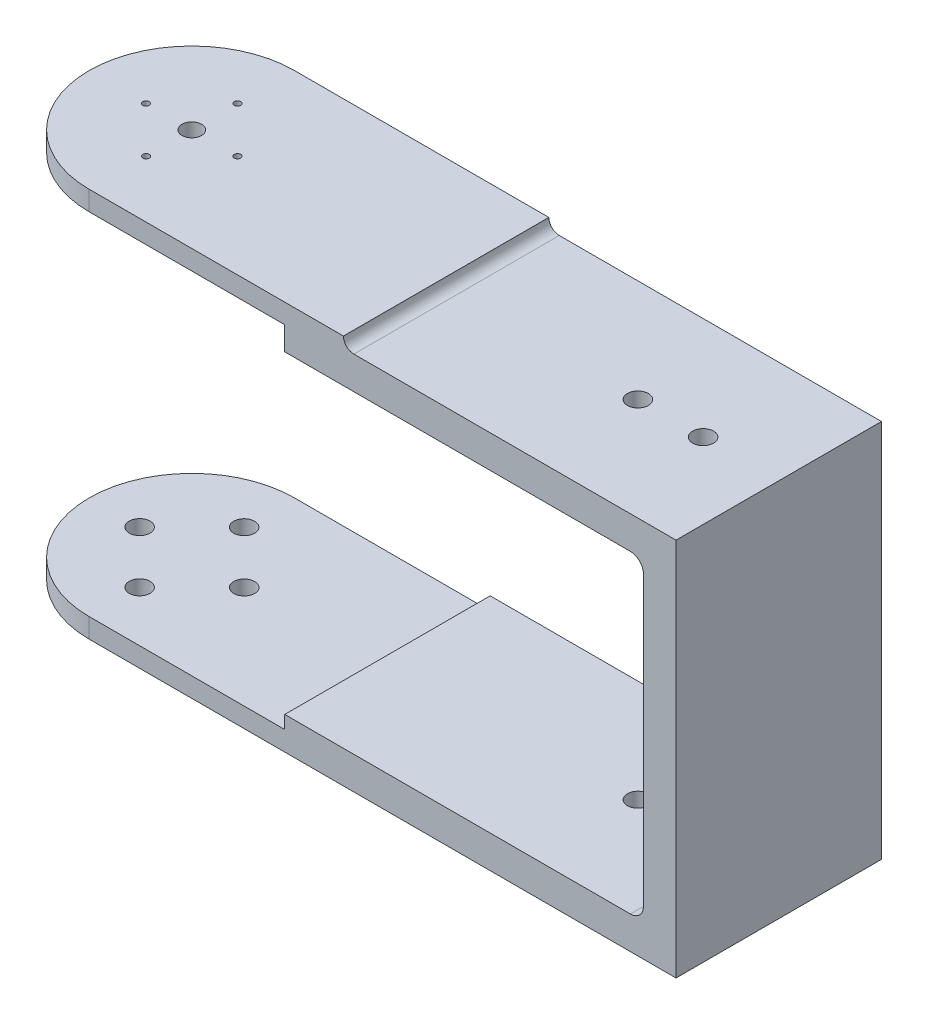
ISO-10303-21;
HEADER;
FILE_DESCRIPTION(('STEP AP214'),'2;1');
FILE_NAME('part.step','',(''),(''),'','','');
FILE_SCHEMA(('AUTOMOTIVE_DESIGN { 1 0 10303 214 1 1 1 1 }'));
ENDSEC;
DATA;
#1=APPLICATION_CONTEXT('core data for automotive mechanical design processes');
#2=APPLICATION_PROTOCOL_DEFINITION('international standard','automotive_design',2000,#1);
#3=PRODUCT_CONTEXT('',#1,'mechanical');
#4=PRODUCT('Part','Part','',(#3));
#5=PRODUCT_RELATED_PRODUCT_CATEGORY('part','',(#4));
#6=PRODUCT_DEFINITION_FORMATION('','',#4);
#7=PRODUCT_DEFINITION_CONTEXT('part definition',#1,'design');
#8=PRODUCT_DEFINITION('design','',#6,#7);
#9=PRODUCT_DEFINITION_SHAPE('','',#8);
#10=(LENGTH_UNIT() NAMED_UNIT(*) SI_UNIT(.MILLI.,.METRE.));
#11=(NAMED_UNIT(*) PLANE_ANGLE_UNIT() SI_UNIT($,.RADIAN.));
#12=(NAMED_UNIT(*) SI_UNIT($,.STERADIAN.) SOLID_ANGLE_UNIT());
#13=UNCERTAINTY_MEASURE_WITH_UNIT(LENGTH_MEASURE(1.E-05),#10,'distance_accuracy_value','');
#14=(GEOMETRIC_REPRESENTATION_CONTEXT(3) GLOBAL_UNCERTAINTY_ASSIGNED_CONTEXT((#13)) GLOBAL_UNIT_ASSIGNED_CONTEXT((#10,
#11,#12)) REPRESENTATION_CONTEXT('',''));
#15=CARTESIAN_POINT('',(0.,0.,0.));
#16=DIRECTION('',(0.,0.,1.));
#17=DIRECTION('',(1.,0.,0.));
#18=AXIS2_PLACEMENT_3D('',#15,#16,#17);
#19=CARTESIAN_POINT('',(0.,1.6,0.));
#20=DIRECTION('',(0.,-1.,0.));
#21=DIRECTION('',(0.,0.,-1.));
#22=AXIS2_PLACEMENT_3D('',#19,#20,#21);
#23=PLANE('',#22);
#24=DIRECTION('',(1.,0.,0.));
#25=VECTOR('',#24,1.);
#26=CARTESIAN_POINT('',(0.,1.6,-15.75));
#27=LINE('',#26,#25);
#28=CARTESIAN_POINT('',(0.,1.6,-15.75));
#29=VERTEX_POINT('',#28);
#30=CARTESIAN_POINT('',(30.,1.6,-15.75));
#31=VERTEX_POINT('',#30);
#32=EDGE_CURVE('E193',#29,#31,#27,.T.);
#33=ORIENTED_EDGE('',*,*,#32,.T.);
#34=DIRECTION('',(0.,0.,1.));
#35=VECTOR('',#34,1.);
#36=CARTESIAN_POINT('',(30.,1.6,-15.75));
#37=LINE('',#36,#35);
#38=CARTESIAN_POINT('',(30.,1.6,15.75));
#39=VERTEX_POINT('',#38);
#40=EDGE_CURVE('E196',#31,#39,#37,.T.);
#41=ORIENTED_EDGE('',*,*,#40,.T.);
#42=DIRECTION('',(-1.,0.,0.));
#43=VECTOR('',#42,1.);
#44=CARTESIAN_POINT('',(30.,1.6,15.75));
#45=LINE('',#44,#43);
#46=CARTESIAN_POINT('',(0.,1.6,15.75));
#47=VERTEX_POINT('',#46);
#48=EDGE_CURVE('E199',#39,#47,#45,.T.);
#49=ORIENTED_EDGE('',*,*,#48,.T.);
#50=CARTESIAN_POINT('',(0.,1.6,0.));
#51=DIRECTION('',(0.,-1.,0.));
#52=DIRECTION('',(0.,0.,-1.));
#53=AXIS2_PLACEMENT_3D('',#50,#51,#52);
#54=CIRCLE('',#53,15.75);
#55=EDGE_CURVE('E201',#47,#29,#54,.T.);
#56=ORIENTED_EDGE('',*,*,#55,.T.);
#57=EDGE_LOOP('',(#33,#41,#49,#56));
#58=FACE_BOUND('',#57,.T.);
#59=CARTESIAN_POINT('',(0.,1.6,0.));
#60=DIRECTION('',(0.,-1.,0.));
#61=DIRECTION('',(0.,0.,-1.));
#62=AXIS2_PLACEMENT_3D('',#59,#60,#61);
#63=CIRCLE('',#62,10.);
#64=CARTESIAN_POINT('',(0.,1.6,-10.));
#65=VERTEX_POINT('',#64);
#66=EDGE_CURVE('E176',#65,#65,#63,.T.);
#67=ORIENTED_EDGE('',*,*,#66,.F.);
#68=EDGE_LOOP('',(#67));
#69=FACE_BOUND('',#68,.T.);
#70=ADVANCED_FACE('F40',(#58,#69),#23,.T.);
#71=CARTESIAN_POINT('',(40.6,4.6,0.));
#72=DIRECTION('',(0.,0.,1.));
#73=DIRECTION('',(1.,0.,0.));
#74=AXIS2_PLACEMENT_3D('',#71,#72,#73);
#75=CYLINDRICAL_SURFACE('',#74,1.6);
#76=DIRECTION('',(0.,0.,1.));
#77=VECTOR('',#76,1.);
#78=CARTESIAN_POINT('',(39.,4.6,15.75));
#79=LINE('',#78,#77);
#80=CARTESIAN_POINT('',(39.,4.6,-15.75));
#81=VERTEX_POINT('',#80);
#82=CARTESIAN_POINT('',(39.,4.6,15.75));
#83=VERTEX_POINT('',#82);
#84=EDGE_CURVE('E151',#81,#83,#79,.T.);
#85=ORIENTED_EDGE('',*,*,#84,.T.);
#86=CARTESIAN_POINT('',(40.6,4.6,15.75));
#87=DIRECTION('',(0.,0.,-1.));
#88=DIRECTION('',(-1.,0.,0.));
#89=AXIS2_PLACEMENT_3D('',#86,#87,#88);
#90=CIRCLE('',#89,1.6);
#91=CARTESIAN_POINT('',(40.6,3.,15.75));
#92=VERTEX_POINT('',#91);
#93=EDGE_CURVE('E61',#83,#92,#90,.F.);
#94=ORIENTED_EDGE('',*,*,#93,.T.);
#95=DIRECTION('',(0.,0.,-1.));
#96=VECTOR('',#95,1.);
#97=CARTESIAN_POINT('',(40.6,3.,0.));
#98=LINE('',#97,#96);
#99=CARTESIAN_POINT('',(40.6,3.,-15.75));
#100=VERTEX_POINT('',#99);
#101=EDGE_CURVE('E152',#100,#92,#98,.F.);
#102=ORIENTED_EDGE('',*,*,#101,.F.);
#103=CARTESIAN_POINT('',(40.6,4.6,-15.75));
#104=DIRECTION('',(0.,0.,1.));
#105=DIRECTION('',(1.,0.,0.));
#106=AXIS2_PLACEMENT_3D('',#103,#104,#105);
#107=CIRCLE('',#106,1.6);
#108=EDGE_CURVE('E48',#100,#81,#107,.F.);
#109=ORIENTED_EDGE('',*,*,#108,.T.);
#110=EDGE_LOOP('',(#85,#94,#102,#109));
#111=FACE_BOUND('',#110,.T.);
#112=ADVANCED_FACE('F42',(#111),#75,.F.);
#113=CARTESIAN_POINT('',(0.,3.,0.));
#114=DIRECTION('',(0.,-1.,0.));
#115=DIRECTION('',(0.,0.,-1.));
#116=AXIS2_PLACEMENT_3D('',#113,#114,#115);
#117=CYLINDRICAL_SURFACE('',#116,15.75);
#118=ORIENTED_EDGE('',*,*,#55,.F.);
#119=DIRECTION('',(0.,-1.,0.));
#120=VECTOR('',#119,1.);
#121=CARTESIAN_POINT('',(0.,3.,15.75));
#122=LINE('',#121,#120);
#123=CARTESIAN_POINT('',(0.,4.6,15.75));
#124=VERTEX_POINT('',#123);
#125=EDGE_CURVE('E291',#124,#47,#122,.T.);
#126=ORIENTED_EDGE('',*,*,#125,.F.);
#127=CARTESIAN_POINT('',(0.,4.6,0.));
#128=DIRECTION('',(0.,-1.,0.));
#129=DIRECTION('',(0.,0.,-1.));
#130=AXIS2_PLACEMENT_3D('',#127,#128,#129);
#131=CIRCLE('',#130,15.75);
#132=CARTESIAN_POINT('',(0.,4.6,-15.75));
#133=VERTEX_POINT('',#132);
#134=EDGE_CURVE('E164',#124,#133,#131,.T.);
#135=ORIENTED_EDGE('',*,*,#134,.T.);
#136=DIRECTION('',(0.,-1.,0.));
#137=VECTOR('',#136,1.);
#138=CARTESIAN_POINT('',(0.,3.,-15.75));
#139=LINE('',#138,#137);
#140=EDGE_CURVE('E159',#133,#29,#139,.T.);
#141=ORIENTED_EDGE('',*,*,#140,.T.);
#142=EDGE_LOOP('',(#118,#126,#135,#141));
#143=FACE_BOUND('',#142,.T.);
#144=ADVANCED_FACE('F382',(#143),#117,.T.);
#145=CARTESIAN_POINT('',(-7.,10.,0.));
#146=DIRECTION('',(0.,-1.,0.));
#147=DIRECTION('',(0.,0.,-1.));
#148=AXIS2_PLACEMENT_3D('',#145,#146,#147);
#149=CYLINDRICAL_SURFACE('',#148,0.5);
#150=CARTESIAN_POINT('',(-7.,4.6,0.));
#151=DIRECTION('',(0.,-1.,0.));
#152=DIRECTION('',(0.,0.,-1.));
#153=AXIS2_PLACEMENT_3D('',#150,#151,#152);
#154=CIRCLE('',#153,0.5);
#155=CARTESIAN_POINT('',(-7.,4.6,-0.5));
#156=VERTEX_POINT('',#155);
#157=EDGE_CURVE('E185',#156,#156,#154,.T.);
#158=ORIENTED_EDGE('',*,*,#157,.F.);
#159=EDGE_LOOP('',(#158));
#160=FACE_BOUND('',#159,.T.);
#161=CARTESIAN_POINT('',(-7.,0.,0.));
#162=DIRECTION('',(0.,-1.,0.));
#163=DIRECTION('',(0.,0.,-1.));
#164=AXIS2_PLACEMENT_3D('',#161,#162,#163);
#165=CIRCLE('',#164,0.5);
#166=CARTESIAN_POINT('',(-7.,0.,-0.5));
#167=VERTEX_POINT('',#166);
#168=EDGE_CURVE('E440',#167,#167,#165,.T.);
#169=ORIENTED_EDGE('',*,*,#168,.T.);
#170=EDGE_LOOP('',(#169));
#171=FACE_BOUND('',#170,.T.);
#172=ADVANCED_FACE('F384',(#160,#171),#149,.F.);
#173=CARTESIAN_POINT('',(0.,10.,-7.));
#174=DIRECTION('',(0.,-1.,0.));
#175=DIRECTION('',(0.,0.,-1.));
#176=AXIS2_PLACEMENT_3D('',#173,#174,#175);
#177=CYLINDRICAL_SURFACE('',#176,0.5);
#178=CARTESIAN_POINT('',(0.,4.6,-7.));
#179=DIRECTION('',(0.,-1.,0.));
#180=DIRECTION('',(0.,0.,-1.));
#181=AXIS2_PLACEMENT_3D('',#178,#179,#180);
#182=CIRCLE('',#181,0.500000000000001);
#183=CARTESIAN_POINT('',(0.,4.6,-7.5));
#184=VERTEX_POINT('',#183);
#185=EDGE_CURVE('E188',#184,#184,#182,.T.);
#186=ORIENTED_EDGE('',*,*,#185,.F.);
#187=EDGE_LOOP('',(#186));
#188=FACE_BOUND('',#187,.T.);
#189=CARTESIAN_POINT('',(0.,0.,-7.));
#190=DIRECTION('',(0.,-1.,0.));
#191=DIRECTION('',(0.,0.,-1.));
#192=AXIS2_PLACEMENT_3D('',#189,#190,#191);
#193=CIRCLE('',#192,0.500000000000001);
#194=CARTESIAN_POINT('',(0.,0.,-7.5));
#195=VERTEX_POINT('',#194);
#196=EDGE_CURVE('E437',#195,#195,#193,.T.);
#197=ORIENTED_EDGE('',*,*,#196,.T.);
#198=EDGE_LOOP('',(#197));
#199=FACE_BOUND('',#198,.T.);
#200=ADVANCED_FACE('F391',(#188,#199),#177,.F.);
#201=CARTESIAN_POINT('',(7.,10.,0.));
#202=DIRECTION('',(0.,-1.,0.));
#203=DIRECTION('',(0.,0.,-1.));
#204=AXIS2_PLACEMENT_3D('',#201,#202,#203);
#205=CYLINDRICAL_SURFACE('',#204,0.5);
#206=CARTESIAN_POINT('',(7.,4.6,0.));
#207=DIRECTION('',(0.,-1.,0.));
#208=DIRECTION('',(0.,0.,-1.));
#209=AXIS2_PLACEMENT_3D('',#206,#207,#208);
#210=CIRCLE('',#209,0.5);
#211=CARTESIAN_POINT('',(7.,4.6,-0.5));
#212=VERTEX_POINT('',#211);
#213=EDGE_CURVE('E169',#212,#212,#210,.T.);
#214=ORIENTED_EDGE('',*,*,#213,.F.);
#215=EDGE_LOOP('',(#214));
#216=FACE_BOUND('',#215,.T.);
#217=CARTESIAN_POINT('',(7.,0.,0.));
#218=DIRECTION('',(0.,-1.,0.));
#219=DIRECTION('',(0.,0.,-1.));
#220=AXIS2_PLACEMENT_3D('',#217,#218,#219);
#221=CIRCLE('',#220,0.5);
#222=CARTESIAN_POINT('',(7.,0.,-0.5));
#223=VERTEX_POINT('',#222);
#224=EDGE_CURVE('E439',#223,#223,#221,.T.);
#225=ORIENTED_EDGE('',*,*,#224,.T.);
#226=EDGE_LOOP('',(#225));
#227=FACE_BOUND('',#226,.T.);
#228=ADVANCED_FACE('F433',(#216,#227),#205,.F.);
#229=CARTESIAN_POINT('',(0.,10.,7.));
#230=DIRECTION('',(0.,-1.,0.));
#231=DIRECTION('',(0.,0.,-1.));
#232=AXIS2_PLACEMENT_3D('',#229,#230,#231);
#233=CYLINDRICAL_SURFACE('',#232,0.5);
#234=CARTESIAN_POINT('',(0.,4.6,7.));
#235=DIRECTION('',(0.,-1.,0.));
#236=DIRECTION('',(0.,0.,-1.));
#237=AXIS2_PLACEMENT_3D('',#234,#235,#236);
#238=CIRCLE('',#237,0.500000000000001);
#239=CARTESIAN_POINT('',(0.,4.6,6.5));
#240=VERTEX_POINT('',#239);
#241=EDGE_CURVE('E173',#240,#240,#238,.T.);
#242=ORIENTED_EDGE('',*,*,#241,.F.);
#243=EDGE_LOOP('',(#242));
#244=FACE_BOUND('',#243,.T.);
#245=CARTESIAN_POINT('',(0.,0.,7.));
#246=DIRECTION('',(0.,-1.,0.));
#247=DIRECTION('',(0.,0.,-1.));
#248=AXIS2_PLACEMENT_3D('',#245,#246,#247);
#249=CIRCLE('',#248,0.5);
#250=CARTESIAN_POINT('',(0.,0.,6.5));
#251=VERTEX_POINT('',#250);
#252=EDGE_CURVE('E446',#251,#251,#249,.T.);
#253=ORIENTED_EDGE('',*,*,#252,.T.);
#254=EDGE_LOOP('',(#253));
#255=FACE_BOUND('',#254,.T.);
#256=ADVANCED_FACE('F422',(#244,#255),#233,.F.);
#257=CARTESIAN_POINT('',(0.,-7.,0.));
#258=DIRECTION('',(0.,1.,0.));
#259=DIRECTION('',(0.,0.,1.));
#260=AXIS2_PLACEMENT_3D('',#257,#258,#259);
#261=CYLINDRICAL_SURFACE('',#260,1.5);
#262=CARTESIAN_POINT('',(0.,1.6,0.));
#263=DIRECTION('',(0.,-1.,0.));
#264=DIRECTION('',(0.,0.,-1.));
#265=AXIS2_PLACEMENT_3D('',#262,#263,#264);
#266=CIRCLE('',#265,1.5);
#267=CARTESIAN_POINT('',(0.,1.6,-1.5));
#268=VERTEX_POINT('',#267);
#269=EDGE_CURVE('E203',#268,#268,#266,.F.);
#270=ORIENTED_EDGE('',*,*,#269,.F.);
#271=EDGE_LOOP('',(#270));
#272=FACE_BOUND('',#271,.T.);
#273=CARTESIAN_POINT('',(0.,4.6,0.));
#274=DIRECTION('',(0.,-1.,0.));
#275=DIRECTION('',(0.,0.,-1.));
#276=AXIS2_PLACEMENT_3D('',#273,#274,#275);
#277=CIRCLE('',#276,1.5);
#278=CARTESIAN_POINT('',(0.,4.6,-1.5));
#279=VERTEX_POINT('',#278);
#280=EDGE_CURVE('E182',#279,#279,#277,.T.);
#281=ORIENTED_EDGE('',*,*,#280,.F.);
#282=EDGE_LOOP('',(#281));
#283=FACE_BOUND('',#282,.T.);
#284=ADVANCED_FACE('F420',(#272,#283),#261,.F.);
#285=CARTESIAN_POINT('',(83.,-48.15,15.75));
#286=DIRECTION('',(0.,0.,-1.));
#287=DIRECTION('',(-1.,0.,0.));
#288=AXIS2_PLACEMENT_3D('',#285,#286,#287);
#289=CYLINDRICAL_SURFACE('',#288,2.);
#290=DIRECTION('',(0.,0.,1.));
#291=VECTOR('',#290,1.);
#292=CARTESIAN_POINT('',(85.,-48.15,15.75));
#293=LINE('',#292,#291);
#294=CARTESIAN_POINT('',(85.,-48.15,-15.75));
#295=VERTEX_POINT('',#294);
#296=CARTESIAN_POINT('',(85.,-48.15,15.75));
#297=VERTEX_POINT('',#296);
#298=EDGE_CURVE('E307',#295,#297,#293,.T.);
#299=ORIENTED_EDGE('',*,*,#298,.F.);
#300=CARTESIAN_POINT('',(83.,-48.15,-15.75));
#301=DIRECTION('',(0.,0.,1.));
#302=DIRECTION('',(1.,0.,0.));
#303=AXIS2_PLACEMENT_3D('',#300,#301,#302);
#304=CIRCLE('',#303,2.);
#305=CARTESIAN_POINT('',(83.,-50.15,-15.75));
#306=VERTEX_POINT('',#305);
#307=EDGE_CURVE('E313',#295,#306,#304,.F.);
#308=ORIENTED_EDGE('',*,*,#307,.T.);
#309=DIRECTION('',(0.,0.,1.));
#310=VECTOR('',#309,1.);
#311=CARTESIAN_POINT('',(83.,-50.15,15.75));
#312=LINE('',#311,#310);
#313=CARTESIAN_POINT('',(83.,-50.15,15.75));
#314=VERTEX_POINT('',#313);
#315=EDGE_CURVE('E310',#314,#306,#312,.F.);
#316=ORIENTED_EDGE('',*,*,#315,.F.);
#317=CARTESIAN_POINT('',(83.,-48.15,15.75));
#318=DIRECTION('',(0.,0.,-1.));
#319=DIRECTION('',(-1.,0.,0.));
#320=AXIS2_PLACEMENT_3D('',#317,#318,#319);
#321=CIRCLE('',#320,2.);
#322=EDGE_CURVE('E315',#314,#297,#321,.F.);
#323=ORIENTED_EDGE('',*,*,#322,.T.);
#324=EDGE_LOOP('',(#299,#308,#316,#323));
#325=FACE_BOUND('',#324,.T.);
#326=ADVANCED_FACE('F360',(#325),#289,.F.);
#327=CARTESIAN_POINT('',(83.,-4.,15.75));
#328=DIRECTION('',(0.,0.,-1.));
#329=DIRECTION('',(-1.,0.,0.));
#330=AXIS2_PLACEMENT_3D('',#327,#328,#329);
#331=CYLINDRICAL_SURFACE('',#330,2.);
#332=DIRECTION('',(0.,0.,-1.));
#333=VECTOR('',#332,1.);
#334=CARTESIAN_POINT('',(85.,-4.,15.75));
#335=LINE('',#334,#333);
#336=CARTESIAN_POINT('',(85.,-4.,15.75));
#337=VERTEX_POINT('',#336);
#338=CARTESIAN_POINT('',(85.,-4.,-15.75));
#339=VERTEX_POINT('',#338);
#340=EDGE_CURVE('E294',#337,#339,#335,.T.);
#341=ORIENTED_EDGE('',*,*,#340,.F.);
#342=CARTESIAN_POINT('',(83.,-4.,15.75));
#343=DIRECTION('',(0.,0.,-1.));
#344=DIRECTION('',(-1.,0.,0.));
#345=AXIS2_PLACEMENT_3D('',#342,#343,#344);
#346=CIRCLE('',#345,2.);
#347=CARTESIAN_POINT('',(83.,-2.,15.75));
#348=VERTEX_POINT('',#347);
#349=EDGE_CURVE('E302',#337,#348,#346,.F.);
#350=ORIENTED_EDGE('',*,*,#349,.T.);
#351=DIRECTION('',(0.,0.,-1.));
#352=VECTOR('',#351,1.);
#353=CARTESIAN_POINT('',(83.,-2.,0.));
#354=LINE('',#353,#352);
#355=CARTESIAN_POINT('',(83.,-2.,-15.75));
#356=VERTEX_POINT('',#355);
#357=EDGE_CURVE('E299',#356,#348,#354,.F.);
#358=ORIENTED_EDGE('',*,*,#357,.F.);
#359=CARTESIAN_POINT('',(83.,-4.,-15.75));
#360=DIRECTION('',(0.,0.,1.));
#361=DIRECTION('',(1.,0.,0.));
#362=AXIS2_PLACEMENT_3D('',#359,#360,#361);
#363=CIRCLE('',#362,2.);
#364=EDGE_CURVE('E304',#356,#339,#363,.F.);
#365=ORIENTED_EDGE('',*,*,#364,.T.);
#366=EDGE_LOOP('',(#341,#350,#358,#365));
#367=FACE_BOUND('',#366,.T.);
#368=ADVANCED_FACE('F366',(#367),#331,.F.);
#369=CARTESIAN_POINT('',(0.,-55.15,0.));
#370=DIRECTION('',(0.,1.,0.));
#371=DIRECTION('',(0.,0.,1.));
#372=AXIS2_PLACEMENT_3D('',#369,#370,#371);
#373=CYLINDRICAL_SURFACE('',#372,15.75);
#374=CARTESIAN_POINT('',(0.,-52.15,0.));
#375=DIRECTION('',(0.,1.,0.));
#376=DIRECTION('',(0.,0.,1.));
#377=AXIS2_PLACEMENT_3D('',#374,#375,#376);
#378=CIRCLE('',#377,15.75);
#379=CARTESIAN_POINT('',(0.,-52.15,-15.75));
#380=VERTEX_POINT('',#379);
#381=CARTESIAN_POINT('',(0.,-52.15,15.75));
#382=VERTEX_POINT('',#381);
#383=EDGE_CURVE('E229',#380,#382,#378,.T.);
#384=ORIENTED_EDGE('',*,*,#383,.F.);
#385=DIRECTION('',(0.,1.,0.));
#386=VECTOR('',#385,1.);
#387=CARTESIAN_POINT('',(0.,-55.15,-15.75));
#388=LINE('',#387,#386);
#389=CARTESIAN_POINT('',(0.,-55.15,-15.75));
#390=VERTEX_POINT('',#389);
#391=EDGE_CURVE('E255',#390,#380,#388,.T.);
#392=ORIENTED_EDGE('',*,*,#391,.F.);
#393=CARTESIAN_POINT('',(0.,-55.15,0.));
#394=DIRECTION('',(0.,-1.,0.));
#395=DIRECTION('',(0.,0.,-1.));
#396=AXIS2_PLACEMENT_3D('',#393,#394,#395);
#397=CIRCLE('',#396,15.75);
#398=CARTESIAN_POINT('',(0.,-55.15,15.75));
#399=VERTEX_POINT('',#398);
#400=EDGE_CURVE('E250',#399,#390,#397,.T.);
#401=ORIENTED_EDGE('',*,*,#400,.F.);
#402=DIRECTION('',(0.,1.,0.));
#403=VECTOR('',#402,1.);
#404=CARTESIAN_POINT('',(0.,-55.15,15.75));
#405=LINE('',#404,#403);
#406=EDGE_CURVE('E261',#399,#382,#405,.T.);
#407=ORIENTED_EDGE('',*,*,#406,.T.);
#408=EDGE_LOOP('',(#384,#392,#401,#407));
#409=FACE_BOUND('',#408,.T.);
#410=ADVANCED_FACE('F341',(#409),#373,.T.);
#411=CARTESIAN_POINT('',(8.03393099042717,-55.15,0.));
#412=DIRECTION('',(0.,1.,0.));
#413=DIRECTION('',(0.,0.,1.));
#414=AXIS2_PLACEMENT_3D('',#411,#412,#413);
#415=CYLINDRICAL_SURFACE('',#414,1.6);
#416=CARTESIAN_POINT('',(8.03393099042717,-55.15,0.));
#417=DIRECTION('',(0.,-1.,0.));
#418=DIRECTION('',(0.,0.,-1.));
#419=AXIS2_PLACEMENT_3D('',#416,#417,#418);
#420=CIRCLE('',#419,1.6);
#421=CARTESIAN_POINT('',(8.03393099042717,-55.15,-1.6));
#422=VERTEX_POINT('',#421);
#423=EDGE_CURVE('E240',#422,#422,#420,.T.);
#424=ORIENTED_EDGE('',*,*,#423,.T.);
#425=EDGE_LOOP('',(#424));
#426=FACE_BOUND('',#425,.T.);
#427=CARTESIAN_POINT('',(8.03393099042717,-52.15,0.));
#428=DIRECTION('',(0.,1.,0.));
#429=DIRECTION('',(0.,0.,1.));
#430=AXIS2_PLACEMENT_3D('',#427,#428,#429);
#431=CIRCLE('',#430,1.6);
#432=CARTESIAN_POINT('',(8.03393099042717,-52.15,1.6));
#433=VERTEX_POINT('',#432);
#434=EDGE_CURVE('E226',#433,#433,#431,.T.);
#435=ORIENTED_EDGE('',*,*,#434,.T.);
#436=EDGE_LOOP('',(#435));
#437=FACE_BOUND('',#436,.T.);
#438=ADVANCED_FACE('F552',(#426,#437),#415,.F.);
#439=CARTESIAN_POINT('',(0.,-55.15,7.99999999999999));
#440=DIRECTION('',(0.,1.,0.));
#441=DIRECTION('',(0.,0.,1.));
#442=AXIS2_PLACEMENT_3D('',#439,#440,#441);
#443=CYLINDRICAL_SURFACE('',#442,1.6);
#444=CARTESIAN_POINT('',(0.,-55.15,7.99999999999999));
#445=DIRECTION('',(0.,-1.,0.));
#446=DIRECTION('',(0.,0.,-1.));
#447=AXIS2_PLACEMENT_3D('',#444,#445,#446);
#448=CIRCLE('',#447,1.6);
#449=CARTESIAN_POINT('',(0.,-55.15,6.39999999999999));
#450=VERTEX_POINT('',#449);
#451=EDGE_CURVE('E237',#450,#450,#448,.T.);
#452=ORIENTED_EDGE('',*,*,#451,.T.);
#453=EDGE_LOOP('',(#452));
#454=FACE_BOUND('',#453,.T.);
#455=CARTESIAN_POINT('',(0.,-52.15,7.99999999999999));
#456=DIRECTION('',(0.,1.,0.));
#457=DIRECTION('',(0.,0.,1.));
#458=AXIS2_PLACEMENT_3D('',#455,#456,#457);
#459=CIRCLE('',#458,1.6);
#460=CARTESIAN_POINT('',(0.,-52.15,9.59999999999999));
#461=VERTEX_POINT('',#460);
#462=EDGE_CURVE('E223',#461,#461,#459,.T.);
#463=ORIENTED_EDGE('',*,*,#462,.T.);
#464=EDGE_LOOP('',(#463));
#465=FACE_BOUND('',#464,.T.);
#466=ADVANCED_FACE('F545',(#454,#465),#443,.F.);
#467=CARTESIAN_POINT('',(0.0339309904271679,-55.15,-7.99992804266942));
#468=DIRECTION('',(0.,1.,0.));
#469=DIRECTION('',(0.,0.,1.));
#470=AXIS2_PLACEMENT_3D('',#467,#468,#469);
#471=CYLINDRICAL_SURFACE('',#470,1.6);
#472=CARTESIAN_POINT('',(0.0339309904271679,-55.15,-7.99992804266942));
#473=DIRECTION('',(0.,-1.,0.));
#474=DIRECTION('',(0.,0.,-1.));
#475=AXIS2_PLACEMENT_3D('',#472,#473,#474);
#476=CIRCLE('',#475,1.6);
#477=CARTESIAN_POINT('',(0.0339309904271679,-55.15,-9.59992804266942));
#478=VERTEX_POINT('',#477);
#479=EDGE_CURVE('E234',#478,#478,#476,.T.);
#480=ORIENTED_EDGE('',*,*,#479,.T.);
#481=EDGE_LOOP('',(#480));
#482=FACE_BOUND('',#481,.T.);
#483=CARTESIAN_POINT('',(0.0339309904271679,-52.15,-7.99992804266942));
#484=DIRECTION('',(0.,1.,0.));
#485=DIRECTION('',(0.,0.,1.));
#486=AXIS2_PLACEMENT_3D('',#483,#484,#485);
#487=CIRCLE('',#486,1.6);
#488=CARTESIAN_POINT('',(0.0339309904271679,-52.15,-6.39992804266942));
#489=VERTEX_POINT('',#488);
#490=EDGE_CURVE('E220',#489,#489,#487,.T.);
#491=ORIENTED_EDGE('',*,*,#490,.T.);
#492=EDGE_LOOP('',(#491));
#493=FACE_BOUND('',#492,.T.);
#494=ADVANCED_FACE('F539',(#482,#493),#471,.F.);
#495=CARTESIAN_POINT('',(-8.,-55.15,0.));
#496=DIRECTION('',(0.,1.,0.));
#497=DIRECTION('',(0.,0.,1.));
#498=AXIS2_PLACEMENT_3D('',#495,#496,#497);
#499=CYLINDRICAL_SURFACE('',#498,1.6);
#500=CARTESIAN_POINT('',(-8.,-55.15,0.));
#501=DIRECTION('',(0.,-1.,0.));
#502=DIRECTION('',(0.,0.,-1.));
#503=AXIS2_PLACEMENT_3D('',#500,#501,#502);
#504=CIRCLE('',#503,1.6);
#505=CARTESIAN_POINT('',(-8.,-55.15,-1.6));
#506=VERTEX_POINT('',#505);
#507=EDGE_CURVE('E231',#506,#506,#504,.T.);
#508=ORIENTED_EDGE('',*,*,#507,.T.);
#509=EDGE_LOOP('',(#508));
#510=FACE_BOUND('',#509,.T.);
#511=CARTESIAN_POINT('',(-8.,-52.15,0.));
#512=DIRECTION('',(0.,1.,0.));
#513=DIRECTION('',(0.,0.,1.));
#514=AXIS2_PLACEMENT_3D('',#511,#512,#513);
#515=CIRCLE('',#514,1.6);
#516=CARTESIAN_POINT('',(-8.,-52.15,1.6));
#517=VERTEX_POINT('',#516);
#518=EDGE_CURVE('E217',#517,#517,#515,.T.);
#519=ORIENTED_EDGE('',*,*,#518,.T.);
#520=EDGE_LOOP('',(#519));
#521=FACE_BOUND('',#520,.T.);
#522=ADVANCED_FACE('F534',(#510,#521),#499,.F.);
#523=CARTESIAN_POINT('',(0.,3.,15.75));
#524=DIRECTION('',(0.,0.,-1.));
#525=DIRECTION('',(-1.,0.,0.));
#526=AXIS2_PLACEMENT_3D('',#523,#524,#525);
#527=PLANE('',#526);
#528=DIRECTION('',(1.,0.,0.));
#529=VECTOR('',#528,1.);
#530=CARTESIAN_POINT('',(0.,3.,15.75));
#531=LINE('',#530,#529);
#532=CARTESIAN_POINT('',(90.,3.,15.75));
#533=VERTEX_POINT('',#532);
#534=EDGE_CURVE('E280',#92,#533,#531,.T.);
#535=ORIENTED_EDGE('',*,*,#534,.F.);
#536=ORIENTED_EDGE('',*,*,#93,.F.);
#537=DIRECTION('',(-1.,0.,0.));
#538=VECTOR('',#537,1.);
#539=CARTESIAN_POINT('',(30.,4.6,15.75));
#540=LINE('',#539,#538);
#541=EDGE_CURVE('E163',#83,#124,#540,.T.);
#542=ORIENTED_EDGE('',*,*,#541,.T.);
#543=ORIENTED_EDGE('',*,*,#125,.T.);
#544=ORIENTED_EDGE('',*,*,#48,.F.);
#545=DIRECTION('',(0.,1.,0.));
#546=VECTOR('',#545,1.);
#547=CARTESIAN_POINT('',(30.,-2.,15.75));
#548=LINE('',#547,#546);
#549=CARTESIAN_POINT('',(30.,-2.,15.75));
#550=VERTEX_POINT('',#549);
#551=EDGE_CURVE('E276',#550,#39,#548,.T.);
#552=ORIENTED_EDGE('',*,*,#551,.F.);
#553=DIRECTION('',(-1.,0.,0.));
#554=VECTOR('',#553,1.);
#555=CARTESIAN_POINT('',(30.,-2.,15.75));
#556=LINE('',#555,#554);
#557=EDGE_CURVE('E274',#348,#550,#556,.T.);
#558=ORIENTED_EDGE('',*,*,#557,.F.);
#559=ORIENTED_EDGE('',*,*,#349,.F.);
#560=DIRECTION('',(0.,1.,0.));
#561=VECTOR('',#560,1.);
#562=CARTESIAN_POINT('',(85.,-50.15,15.75));
#563=LINE('',#562,#561);
#564=EDGE_CURVE('E266',#297,#337,#563,.T.);
#565=ORIENTED_EDGE('',*,*,#564,.F.);
#566=ORIENTED_EDGE('',*,*,#322,.F.);
#567=DIRECTION('',(-1.,0.,0.));
#568=VECTOR('',#567,1.);
#569=CARTESIAN_POINT('',(90.,-50.15,15.75));
#570=LINE('',#569,#568);
#571=CARTESIAN_POINT('',(30.,-50.15,15.75));
#572=VERTEX_POINT('',#571);
#573=EDGE_CURVE('E243',#314,#572,#570,.T.);
#574=ORIENTED_EDGE('',*,*,#573,.T.);
#575=DIRECTION('',(0.,1.,0.));
#576=VECTOR('',#575,1.);
#577=CARTESIAN_POINT('',(30.,-52.15,15.75));
#578=LINE('',#577,#576);
#579=CARTESIAN_POINT('',(30.,-52.15,15.75));
#580=VERTEX_POINT('',#579);
#581=EDGE_CURVE('E212',#580,#572,#578,.T.);
#582=ORIENTED_EDGE('',*,*,#581,.F.);
#583=DIRECTION('',(1.,0.,0.));
#584=VECTOR('',#583,1.);
#585=CARTESIAN_POINT('',(0.,-52.15,15.75));
#586=LINE('',#585,#584);
#587=EDGE_CURVE('E206',#382,#580,#586,.T.);
#588=ORIENTED_EDGE('',*,*,#587,.F.);
#589=ORIENTED_EDGE('',*,*,#406,.F.);
#590=DIRECTION('',(-1.,0.,0.));
#591=VECTOR('',#590,1.);
#592=CARTESIAN_POINT('',(90.,-55.15,15.75));
#593=LINE('',#592,#591);
#594=CARTESIAN_POINT('',(90.,-55.15,15.75));
#595=VERTEX_POINT('',#594);
#596=EDGE_CURVE('E247',#595,#399,#593,.T.);
#597=ORIENTED_EDGE('',*,*,#596,.F.);
#598=DIRECTION('',(0.,-1.,0.));
#599=VECTOR('',#598,1.);
#600=CARTESIAN_POINT('',(90.,3.,15.75));
#601=LINE('',#600,#599);
#602=EDGE_CURVE('E289',#533,#595,#601,.T.);
#603=ORIENTED_EDGE('',*,*,#602,.F.);
#604=EDGE_LOOP('',(#535,#536,#542,#543,#544,#552,#558,#559,#565,#566,#574,#582,#588,#589,#597,#603));
#605=FACE_BOUND('',#604,.T.);
#606=ADVANCED_FACE('F325',(#605),#527,.F.);
#607=CARTESIAN_POINT('',(90.,3.,15.75));
#608=DIRECTION('',(-1.,0.,0.));
#609=DIRECTION('',(0.,0.,1.));
#610=AXIS2_PLACEMENT_3D('',#607,#608,#609);
#611=PLANE('',#610);
#612=ORIENTED_EDGE('',*,*,#602,.T.);
#613=DIRECTION('',(0.,0.,1.));
#614=VECTOR('',#613,1.);
#615=CARTESIAN_POINT('',(90.,-55.15,15.75));
#616=LINE('',#615,#614);
#617=CARTESIAN_POINT('',(90.,-55.15,-15.75));
#618=VERTEX_POINT('',#617);
#619=EDGE_CURVE('E244',#618,#595,#616,.T.);
#620=ORIENTED_EDGE('',*,*,#619,.F.);
#621=DIRECTION('',(0.,-1.,0.));
#622=VECTOR('',#621,1.);
#623=CARTESIAN_POINT('',(90.,3.,-15.75));
#624=LINE('',#623,#622);
#625=CARTESIAN_POINT('',(90.,3.,-15.75));
#626=VERTEX_POINT('',#625);
#627=EDGE_CURVE('E287',#626,#618,#624,.T.);
#628=ORIENTED_EDGE('',*,*,#627,.F.);
#629=DIRECTION('',(0.,0.,-1.));
#630=VECTOR('',#629,1.);
#631=CARTESIAN_POINT('',(90.,3.,15.75));
#632=LINE('',#631,#630);
#633=EDGE_CURVE('E282',#533,#626,#632,.T.);
#634=ORIENTED_EDGE('',*,*,#633,.F.);
#635=EDGE_LOOP('',(#612,#620,#628,#634));
#636=FACE_BOUND('',#635,.T.);
#637=ADVANCED_FACE('F332',(#636),#611,.F.);
#638=CARTESIAN_POINT('',(90.,3.,-15.75));
#639=DIRECTION('',(0.,0.,1.));
#640=DIRECTION('',(1.,0.,0.));
#641=AXIS2_PLACEMENT_3D('',#638,#639,#640);
#642=PLANE('',#641);
#643=DIRECTION('',(0.,1.,0.));
#644=VECTOR('',#643,1.);
#645=CARTESIAN_POINT('',(30.,-2.,-15.75));
#646=LINE('',#645,#644);
#647=CARTESIAN_POINT('',(30.,-2.,-15.75));
#648=VERTEX_POINT('',#647);
#649=EDGE_CURVE('E278',#648,#31,#646,.T.);
#650=ORIENTED_EDGE('',*,*,#649,.T.);
#651=ORIENTED_EDGE('',*,*,#32,.F.);
#652=ORIENTED_EDGE('',*,*,#140,.F.);
#653=DIRECTION('',(1.,0.,0.));
#654=VECTOR('',#653,1.);
#655=CARTESIAN_POINT('',(0.,4.6,-15.75));
#656=LINE('',#655,#654);
#657=EDGE_CURVE('E155',#133,#81,#656,.T.);
#658=ORIENTED_EDGE('',*,*,#657,.T.);
#659=ORIENTED_EDGE('',*,*,#108,.F.);
#660=DIRECTION('',(-1.,0.,0.));
#661=VECTOR('',#660,1.);
#662=CARTESIAN_POINT('',(90.,3.,-15.75));
#663=LINE('',#662,#661);
#664=EDGE_CURVE('E284',#626,#100,#663,.T.);
#665=ORIENTED_EDGE('',*,*,#664,.F.);
#666=ORIENTED_EDGE('',*,*,#627,.T.);
#667=DIRECTION('',(1.,0.,0.));
#668=VECTOR('',#667,1.);
#669=CARTESIAN_POINT('',(90.,-55.15,-15.75));
#670=LINE('',#669,#668);
#671=EDGE_CURVE('E252',#390,#618,#670,.T.);
#672=ORIENTED_EDGE('',*,*,#671,.F.);
#673=ORIENTED_EDGE('',*,*,#391,.T.);
#674=DIRECTION('',(-1.,0.,0.));
#675=VECTOR('',#674,1.);
#676=CARTESIAN_POINT('',(0.,-52.15,-15.75));
#677=LINE('',#676,#675);
#678=CARTESIAN_POINT('',(30.,-52.15,-15.75));
#679=VERTEX_POINT('',#678);
#680=EDGE_CURVE('E204',#679,#380,#677,.T.);
#681=ORIENTED_EDGE('',*,*,#680,.F.);
#682=DIRECTION('',(0.,1.,0.));
#683=VECTOR('',#682,1.);
#684=CARTESIAN_POINT('',(30.,-52.15,-15.75));
#685=LINE('',#684,#683);
#686=CARTESIAN_POINT('',(30.,-50.15,-15.75));
#687=VERTEX_POINT('',#686);
#688=EDGE_CURVE('E214',#679,#687,#685,.T.);
#689=ORIENTED_EDGE('',*,*,#688,.T.);
#690=DIRECTION('',(1.,0.,0.));
#691=VECTOR('',#690,1.);
#692=CARTESIAN_POINT('',(90.,-50.15,-15.75));
#693=LINE('',#692,#691);
#694=EDGE_CURVE('E248',#687,#306,#693,.T.);
#695=ORIENTED_EDGE('',*,*,#694,.T.);
#696=ORIENTED_EDGE('',*,*,#307,.F.);
#697=DIRECTION('',(0.,1.,0.));
#698=VECTOR('',#697,1.);
#699=CARTESIAN_POINT('',(85.,-50.15,-15.75));
#700=LINE('',#699,#698);
#701=EDGE_CURVE('E264',#295,#339,#700,.T.);
#702=ORIENTED_EDGE('',*,*,#701,.T.);
#703=ORIENTED_EDGE('',*,*,#364,.F.);
#704=DIRECTION('',(1.,0.,0.));
#705=VECTOR('',#704,1.);
#706=CARTESIAN_POINT('',(30.,-2.,-15.75));
#707=LINE('',#706,#705);
#708=EDGE_CURVE('E271',#648,#356,#707,.T.);
#709=ORIENTED_EDGE('',*,*,#708,.F.);
#710=EDGE_LOOP('',(#650,#651,#652,#658,#659,#665,#666,#672,#673,#681,#689,#695,#696,#702,#703,#709));
#711=FACE_BOUND('',#710,.T.);
#712=ADVANCED_FACE('F156',(#711),#642,.F.);
#713=CARTESIAN_POINT('',(0.,3.,0.));
#714=DIRECTION('',(0.,1.,0.));
#715=DIRECTION('',(0.,0.,1.));
#716=AXIS2_PLACEMENT_3D('',#713,#714,#715);
#717=PLANE('',#716);
#718=CARTESIAN_POINT('',(68.4,3.,0.));
#719=DIRECTION('',(0.,1.,0.));
#720=DIRECTION('',(0.,0.,1.));
#721=AXIS2_PLACEMENT_3D('',#718,#719,#720);
#722=CIRCLE('',#721,1.60000000000001);
#723=CARTESIAN_POINT('',(68.4,3.,1.60000000000001));
#724=VERTEX_POINT('',#723);
#725=EDGE_CURVE('E501',#724,#724,#722,.T.);
#726=ORIENTED_EDGE('',*,*,#725,.F.);
#727=EDGE_LOOP('',(#726));
#728=FACE_BOUND('',#727,.T.);
#729=CARTESIAN_POINT('',(78.4,3.,0.));
#730=DIRECTION('',(0.,1.,0.));
#731=DIRECTION('',(0.,0.,1.));
#732=AXIS2_PLACEMENT_3D('',#729,#730,#731);
#733=CIRCLE('',#732,1.60000000000001);
#734=CARTESIAN_POINT('',(78.4,3.,1.60000000000001));
#735=VERTEX_POINT('',#734);
#736=EDGE_CURVE('E498',#735,#735,#733,.T.);
#737=ORIENTED_EDGE('',*,*,#736,.F.);
#738=EDGE_LOOP('',(#737));
#739=FACE_BOUND('',#738,.T.);
#740=ORIENTED_EDGE('',*,*,#664,.T.);
#741=ORIENTED_EDGE('',*,*,#101,.T.);
#742=ORIENTED_EDGE('',*,*,#534,.T.);
#743=ORIENTED_EDGE('',*,*,#633,.T.);
#744=EDGE_LOOP('',(#740,#741,#742,#743));
#745=FACE_BOUND('',#744,.T.);
#746=ADVANCED_FACE('F322',(#728,#739,#745),#717,.T.);
#747=CARTESIAN_POINT('',(30.,-2.,15.75));
#748=DIRECTION('',(1.,0.,0.));
#749=DIRECTION('',(0.,0.,-1.));
#750=AXIS2_PLACEMENT_3D('',#747,#748,#749);
#751=PLANE('',#750);
#752=ORIENTED_EDGE('',*,*,#551,.T.);
#753=ORIENTED_EDGE('',*,*,#40,.F.);
#754=ORIENTED_EDGE('',*,*,#649,.F.);
#755=DIRECTION('',(0.,0.,-1.));
#756=VECTOR('',#755,1.);
#757=CARTESIAN_POINT('',(30.,-2.,15.75));
#758=LINE('',#757,#756);
#759=EDGE_CURVE('E268',#550,#648,#758,.T.);
#760=ORIENTED_EDGE('',*,*,#759,.F.);
#761=EDGE_LOOP('',(#752,#753,#754,#760));
#762=FACE_BOUND('',#761,.T.);
#763=ADVANCED_FACE('F376',(#762),#751,.F.);
#764=CARTESIAN_POINT('',(0.,-2.,0.));
#765=DIRECTION('',(0.,-1.,0.));
#766=DIRECTION('',(0.,0.,-1.));
#767=AXIS2_PLACEMENT_3D('',#764,#765,#766);
#768=PLANE('',#767);
#769=CARTESIAN_POINT('',(68.4,-2.,0.));
#770=DIRECTION('',(0.,-1.,0.));
#771=DIRECTION('',(0.,0.,-1.));
#772=AXIS2_PLACEMENT_3D('',#769,#770,#771);
#773=CIRCLE('',#772,1.60000000000001);
#774=CARTESIAN_POINT('',(68.4,-2.,-1.60000000000001));
#775=VERTEX_POINT('',#774);
#776=EDGE_CURVE('E497',#775,#775,#773,.T.);
#777=ORIENTED_EDGE('',*,*,#776,.F.);
#778=EDGE_LOOP('',(#777));
#779=FACE_BOUND('',#778,.T.);
#780=CARTESIAN_POINT('',(78.4,-2.,0.));
#781=DIRECTION('',(0.,-1.,0.));
#782=DIRECTION('',(0.,0.,-1.));
#783=AXIS2_PLACEMENT_3D('',#780,#781,#782);
#784=CIRCLE('',#783,1.60000000000001);
#785=CARTESIAN_POINT('',(78.4,-2.,-1.60000000000001));
#786=VERTEX_POINT('',#785);
#787=EDGE_CURVE('E504',#786,#786,#784,.T.);
#788=ORIENTED_EDGE('',*,*,#787,.F.);
#789=EDGE_LOOP('',(#788));
#790=FACE_BOUND('',#789,.T.);
#791=ORIENTED_EDGE('',*,*,#708,.T.);
#792=ORIENTED_EDGE('',*,*,#357,.T.);
#793=ORIENTED_EDGE('',*,*,#557,.T.);
#794=ORIENTED_EDGE('',*,*,#759,.T.);
#795=EDGE_LOOP('',(#791,#792,#793,#794));
#796=FACE_BOUND('',#795,.T.);
#797=ADVANCED_FACE('F372',(#779,#790,#796),#768,.T.);
#798=CARTESIAN_POINT('',(85.,-50.15,15.75));
#799=DIRECTION('',(1.,0.,0.));
#800=DIRECTION('',(0.,0.,-1.));
#801=AXIS2_PLACEMENT_3D('',#798,#799,#800);
#802=PLANE('',#801);
#803=ORIENTED_EDGE('',*,*,#701,.F.);
#804=ORIENTED_EDGE('',*,*,#298,.T.);
#805=ORIENTED_EDGE('',*,*,#564,.T.);
#806=ORIENTED_EDGE('',*,*,#340,.T.);
#807=EDGE_LOOP('',(#803,#804,#805,#806));
#808=FACE_BOUND('',#807,.T.);
#809=ADVANCED_FACE('F362',(#808),#802,.F.);
#810=CARTESIAN_POINT('',(0.,-50.15,0.));
#811=DIRECTION('',(0.,-1.,0.));
#812=DIRECTION('',(0.,0.,-1.));
#813=AXIS2_PLACEMENT_3D('',#810,#811,#812);
#814=PLANE('',#813);
#815=CARTESIAN_POINT('',(68.4,-50.15,0.));
#816=DIRECTION('',(0.,-1.,0.));
#817=DIRECTION('',(0.,0.,-1.));
#818=AXIS2_PLACEMENT_3D('',#815,#816,#817);
#819=CIRCLE('',#818,1.60000000000001);
#820=CARTESIAN_POINT('',(68.4,-50.15,-1.60000000000001));
#821=VERTEX_POINT('',#820);
#822=EDGE_CURVE('E495',#821,#821,#819,.T.);
#823=ORIENTED_EDGE('',*,*,#822,.T.);
#824=EDGE_LOOP('',(#823));
#825=FACE_BOUND('',#824,.T.);
#826=CARTESIAN_POINT('',(78.4,-50.15,0.));
#827=DIRECTION('',(0.,-1.,0.));
#828=DIRECTION('',(0.,0.,-1.));
#829=AXIS2_PLACEMENT_3D('',#826,#827,#828);
#830=CIRCLE('',#829,1.60000000000001);
#831=CARTESIAN_POINT('',(78.4,-50.15,-1.60000000000001));
#832=VERTEX_POINT('',#831);
#833=EDGE_CURVE('E844',#832,#832,#830,.T.);
#834=ORIENTED_EDGE('',*,*,#833,.T.);
#835=EDGE_LOOP('',(#834));
#836=FACE_BOUND('',#835,.T.);
#837=ORIENTED_EDGE('',*,*,#573,.F.);
#838=ORIENTED_EDGE('',*,*,#315,.T.);
#839=ORIENTED_EDGE('',*,*,#694,.F.);
#840=DIRECTION('',(0.,0.,-1.));
#841=VECTOR('',#840,1.);
#842=CARTESIAN_POINT('',(30.,-50.15,-15.75));
#843=LINE('',#842,#841);
#844=EDGE_CURVE('E207',#572,#687,#843,.T.);
#845=ORIENTED_EDGE('',*,*,#844,.F.);
#846=EDGE_LOOP('',(#837,#838,#839,#845));
#847=FACE_BOUND('',#846,.T.);
#848=ADVANCED_FACE('F356',(#825,#836,#847),#814,.F.);
#849=CARTESIAN_POINT('',(0.,-55.15,0.));
#850=DIRECTION('',(0.,-1.,0.));
#851=DIRECTION('',(0.,0.,-1.));
#852=AXIS2_PLACEMENT_3D('',#849,#850,#851);
#853=PLANE('',#852);
#854=CARTESIAN_POINT('',(68.4,-55.15,0.));
#855=DIRECTION('',(0.,-1.,0.));
#856=DIRECTION('',(0.,0.,-1.));
#857=AXIS2_PLACEMENT_3D('',#854,#855,#856);
#858=CIRCLE('',#857,1.60000000000001);
#859=CARTESIAN_POINT('',(68.4,-55.15,-1.60000000000001));
#860=VERTEX_POINT('',#859);
#861=EDGE_CURVE('E492',#860,#860,#858,.T.);
#862=ORIENTED_EDGE('',*,*,#861,.F.);
#863=EDGE_LOOP('',(#862));
#864=FACE_BOUND('',#863,.T.);
#865=CARTESIAN_POINT('',(78.4,-55.15,0.));
#866=DIRECTION('',(0.,-1.,0.));
#867=DIRECTION('',(0.,0.,-1.));
#868=AXIS2_PLACEMENT_3D('',#865,#866,#867);
#869=CIRCLE('',#868,1.60000000000001);
#870=CARTESIAN_POINT('',(78.4,-55.15,-1.60000000000001));
#871=VERTEX_POINT('',#870);
#872=EDGE_CURVE('E848',#871,#871,#869,.T.);
#873=ORIENTED_EDGE('',*,*,#872,.F.);
#874=EDGE_LOOP('',(#873));
#875=FACE_BOUND('',#874,.T.);
#876=ORIENTED_EDGE('',*,*,#479,.F.);
#877=EDGE_LOOP('',(#876));
#878=FACE_BOUND('',#877,.T.);
#879=ORIENTED_EDGE('',*,*,#423,.F.);
#880=EDGE_LOOP('',(#879));
#881=FACE_BOUND('',#880,.T.);
#882=ORIENTED_EDGE('',*,*,#619,.T.);
#883=ORIENTED_EDGE('',*,*,#596,.T.);
#884=ORIENTED_EDGE('',*,*,#400,.T.);
#885=ORIENTED_EDGE('',*,*,#671,.T.);
#886=EDGE_LOOP('',(#882,#883,#884,#885));
#887=FACE_BOUND('',#886,.T.);
#888=ORIENTED_EDGE('',*,*,#451,.F.);
#889=EDGE_LOOP('',(#888));
#890=FACE_BOUND('',#889,.T.);
#891=ORIENTED_EDGE('',*,*,#507,.F.);
#892=EDGE_LOOP('',(#891));
#893=FACE_BOUND('',#892,.T.);
#894=ADVANCED_FACE('F335',(#864,#875,#878,#881,#887,#890,#893),#853,.T.);
#895=CARTESIAN_POINT('',(0.,-52.15,0.));
#896=DIRECTION('',(0.,1.,0.));
#897=DIRECTION('',(0.,0.,1.));
#898=AXIS2_PLACEMENT_3D('',#895,#896,#897);
#899=PLANE('',#898);
#900=ORIENTED_EDGE('',*,*,#518,.F.);
#901=EDGE_LOOP('',(#900));
#902=FACE_BOUND('',#901,.T.);
#903=ORIENTED_EDGE('',*,*,#490,.F.);
#904=EDGE_LOOP('',(#903));
#905=FACE_BOUND('',#904,.T.);
#906=ORIENTED_EDGE('',*,*,#462,.F.);
#907=EDGE_LOOP('',(#906));
#908=FACE_BOUND('',#907,.T.);
#909=ORIENTED_EDGE('',*,*,#434,.F.);
#910=EDGE_LOOP('',(#909));
#911=FACE_BOUND('',#910,.T.);
#912=ORIENTED_EDGE('',*,*,#383,.T.);
#913=ORIENTED_EDGE('',*,*,#587,.T.);
#914=DIRECTION('',(0.,0.,-1.));
#915=VECTOR('',#914,1.);
#916=CARTESIAN_POINT('',(30.,-52.15,-15.75));
#917=LINE('',#916,#915);
#918=EDGE_CURVE('E209',#580,#679,#917,.T.);
#919=ORIENTED_EDGE('',*,*,#918,.T.);
#920=ORIENTED_EDGE('',*,*,#680,.T.);
#921=EDGE_LOOP('',(#912,#913,#919,#920));
#922=FACE_BOUND('',#921,.T.);
#923=ADVANCED_FACE('F345',(#902,#905,#908,#911,#922),#899,.T.);
#924=CARTESIAN_POINT('',(30.,-52.15,-15.75));
#925=DIRECTION('',(1.,0.,0.));
#926=DIRECTION('',(0.,0.,-1.));
#927=AXIS2_PLACEMENT_3D('',#924,#925,#926);
#928=PLANE('',#927);
#929=ORIENTED_EDGE('',*,*,#844,.T.);
#930=ORIENTED_EDGE('',*,*,#688,.F.);
#931=ORIENTED_EDGE('',*,*,#918,.F.);
#932=ORIENTED_EDGE('',*,*,#581,.T.);
#933=EDGE_LOOP('',(#929,#930,#931,#932));
#934=FACE_BOUND('',#933,.T.);
#935=ADVANCED_FACE('F350',(#934),#928,.F.);
#936=CARTESIAN_POINT('',(0.,1.6,0.));
#937=DIRECTION('',(0.,-1.,0.));
#938=DIRECTION('',(0.,0.,-1.));
#939=AXIS2_PLACEMENT_3D('',#936,#937,#938);
#940=CIRCLE('',#939,1.75);
#941=CARTESIAN_POINT('',(0.,1.6,-1.75));
#942=VERTEX_POINT('',#941);
#943=EDGE_CURVE('E11',#942,#942,#940,.F.);
#944=ORIENTED_EDGE('',*,*,#943,.F.);
#945=EDGE_LOOP('',(#944));
#946=FACE_BOUND('',#945,.T.);
#947=ORIENTED_EDGE('',*,*,#269,.T.);
#948=EDGE_LOOP('',(#947));
#949=FACE_BOUND('',#948,.T.);
#950=ADVANCED_FACE('F398',(#946,#949),#23,.T.);
#951=CARTESIAN_POINT('',(0.,4.6,0.));
#952=DIRECTION('',(0.,-1.,0.));
#953=DIRECTION('',(0.,0.,-1.));
#954=AXIS2_PLACEMENT_3D('',#951,#952,#953);
#955=PLANE('',#954);
#956=ORIENTED_EDGE('',*,*,#213,.T.);
#957=EDGE_LOOP('',(#956));
#958=FACE_BOUND('',#957,.T.);
#959=ORIENTED_EDGE('',*,*,#241,.T.);
#960=EDGE_LOOP('',(#959));
#961=FACE_BOUND('',#960,.T.);
#962=ORIENTED_EDGE('',*,*,#280,.T.);
#963=EDGE_LOOP('',(#962));
#964=FACE_BOUND('',#963,.T.);
#965=ORIENTED_EDGE('',*,*,#157,.T.);
#966=EDGE_LOOP('',(#965));
#967=FACE_BOUND('',#966,.T.);
#968=ORIENTED_EDGE('',*,*,#185,.T.);
#969=EDGE_LOOP('',(#968));
#970=FACE_BOUND('',#969,.T.);
#971=ORIENTED_EDGE('',*,*,#134,.F.);
#972=ORIENTED_EDGE('',*,*,#541,.F.);
#973=ORIENTED_EDGE('',*,*,#84,.F.);
#974=ORIENTED_EDGE('',*,*,#657,.F.);
#975=EDGE_LOOP('',(#971,#972,#973,#974));
#976=FACE_BOUND('',#975,.T.);
#977=ADVANCED_FACE('F167',(#958,#961,#964,#967,#970,#976),#955,.F.);
#978=CARTESIAN_POINT('',(0.,0.,0.));
#979=DIRECTION('',(0.,-1.,0.));
#980=DIRECTION('',(0.,0.,-1.));
#981=AXIS2_PLACEMENT_3D('',#978,#979,#980);
#982=PLANE('',#981);
#983=ORIENTED_EDGE('',*,*,#168,.F.);
#984=EDGE_LOOP('',(#983));
#985=FACE_BOUND('',#984,.T.);
#986=ORIENTED_EDGE('',*,*,#224,.F.);
#987=EDGE_LOOP('',(#986));
#988=FACE_BOUND('',#987,.T.);
#989=CARTESIAN_POINT('',(0.,0.,0.));
#990=DIRECTION('',(0.,-1.,0.));
#991=DIRECTION('',(0.,0.,-1.));
#992=AXIS2_PLACEMENT_3D('',#989,#990,#991);
#993=CIRCLE('',#992,10.);
#994=CARTESIAN_POINT('',(0.,0.,-10.));
#995=VERTEX_POINT('',#994);
#996=EDGE_CURVE('E170',#995,#995,#993,.T.);
#997=ORIENTED_EDGE('',*,*,#996,.T.);
#998=EDGE_LOOP('',(#997));
#999=FACE_BOUND('',#998,.T.);
#1000=CARTESIAN_POINT('',(0.,0.,0.));
#1001=DIRECTION('',(0.,-1.,0.));
#1002=DIRECTION('',(0.,0.,-1.));
#1003=AXIS2_PLACEMENT_3D('',#1000,#1001,#1002);
#1004=CIRCLE('',#1003,1.75);
#1005=CARTESIAN_POINT('',(0.,0.,-1.75));
#1006=VERTEX_POINT('',#1005);
#1007=EDGE_CURVE('E443',#1006,#1006,#1004,.T.);
#1008=ORIENTED_EDGE('',*,*,#1007,.F.);
#1009=EDGE_LOOP('',(#1008));
#1010=FACE_BOUND('',#1009,.T.);
#1011=ORIENTED_EDGE('',*,*,#196,.F.);
#1012=EDGE_LOOP('',(#1011));
#1013=FACE_BOUND('',#1012,.T.);
#1014=ORIENTED_EDGE('',*,*,#252,.F.);
#1015=EDGE_LOOP('',(#1014));
#1016=FACE_BOUND('',#1015,.T.);
#1017=ADVANCED_FACE('F412',(#985,#988,#999,#1010,#1013,#1016),#982,.T.);
#1018=CARTESIAN_POINT('',(0.,0.,0.));
#1019=DIRECTION('',(0.,1.,0.));
#1020=DIRECTION('',(0.,0.,1.));
#1021=AXIS2_PLACEMENT_3D('',#1018,#1019,#1020);
#1022=CYLINDRICAL_SURFACE('',#1021,10.);
#1023=ORIENTED_EDGE('',*,*,#996,.F.);
#1024=EDGE_LOOP('',(#1023));
#1025=FACE_BOUND('',#1024,.T.);
#1026=ORIENTED_EDGE('',*,*,#66,.T.);
#1027=EDGE_LOOP('',(#1026));
#1028=FACE_BOUND('',#1027,.T.);
#1029=ADVANCED_FACE('F456',(#1025,#1028),#1022,.T.);
#1030=CARTESIAN_POINT('',(0.,0.,0.));
#1031=DIRECTION('',(0.,1.,0.));
#1032=DIRECTION('',(0.,0.,1.));
#1033=AXIS2_PLACEMENT_3D('',#1030,#1031,#1032);
#1034=CYLINDRICAL_SURFACE('',#1033,1.75);
#1035=ORIENTED_EDGE('',*,*,#1007,.T.);
#1036=EDGE_LOOP('',(#1035));
#1037=FACE_BOUND('',#1036,.T.);
#1038=ORIENTED_EDGE('',*,*,#943,.T.);
#1039=EDGE_LOOP('',(#1038));
#1040=FACE_BOUND('',#1039,.T.);
#1041=ADVANCED_FACE('F458',(#1037,#1040),#1034,.F.);
#1042=CARTESIAN_POINT('',(78.4,12.45,0.));
#1043=DIRECTION('',(0.,-1.,0.));
#1044=DIRECTION('',(0.,0.,-1.));
#1045=AXIS2_PLACEMENT_3D('',#1042,#1043,#1044);
#1046=CYLINDRICAL_SURFACE('',#1045,1.60000000000001);
#1047=ORIENTED_EDGE('',*,*,#872,.T.);
#1048=EDGE_LOOP('',(#1047));
#1049=FACE_BOUND('',#1048,.T.);
#1050=ORIENTED_EDGE('',*,*,#833,.F.);
#1051=EDGE_LOOP('',(#1050));
#1052=FACE_BOUND('',#1051,.T.);
#1053=ADVANCED_FACE('F465',(#1049,#1052),#1046,.F.);
#1054=CARTESIAN_POINT('',(68.4,12.45,0.));
#1055=DIRECTION('',(0.,-1.,0.));
#1056=DIRECTION('',(0.,0.,-1.));
#1057=AXIS2_PLACEMENT_3D('',#1054,#1055,#1056);
#1058=CYLINDRICAL_SURFACE('',#1057,1.60000000000001);
#1059=ORIENTED_EDGE('',*,*,#861,.T.);
#1060=EDGE_LOOP('',(#1059));
#1061=FACE_BOUND('',#1060,.T.);
#1062=ORIENTED_EDGE('',*,*,#822,.F.);
#1063=EDGE_LOOP('',(#1062));
#1064=FACE_BOUND('',#1063,.T.);
#1065=ADVANCED_FACE('F475',(#1061,#1064),#1058,.F.);
#1066=ORIENTED_EDGE('',*,*,#736,.T.);
#1067=EDGE_LOOP('',(#1066));
#1068=FACE_BOUND('',#1067,.T.);
#1069=ORIENTED_EDGE('',*,*,#787,.T.);
#1070=EDGE_LOOP('',(#1069));
#1071=FACE_BOUND('',#1070,.T.);
#1072=ADVANCED_FACE('F471',(#1068,#1071),#1046,.F.);
#1073=ORIENTED_EDGE('',*,*,#725,.T.);
#1074=EDGE_LOOP('',(#1073));
#1075=FACE_BOUND('',#1074,.T.);
#1076=ORIENTED_EDGE('',*,*,#776,.T.);
#1077=EDGE_LOOP('',(#1076));
#1078=FACE_BOUND('',#1077,.T.);
#1079=ADVANCED_FACE('F474',(#1075,#1078),#1058,.F.);
#1080=CLOSED_SHELL('',(#70,#112,#144,#172,#200,#228,#256,#284,#326,#368,#410,#438,#466,#494,
#522,#606,#637,#712,#746,#763,#797,#809,#848,#894,#923,#935,#950,#977,#1017,#1029,#1041,#1053,
#1065,#1072,#1079));
#1081=MANIFOLD_SOLID_BREP('B2',#1080);
#1082=ADVANCED_BREP_SHAPE_REPRESENTATION('',(#18,#1081),#14);
#1083=SHAPE_DEFINITION_REPRESENTATION(#9,#1082);
ENDSEC;
END-ISO-10303-21;
